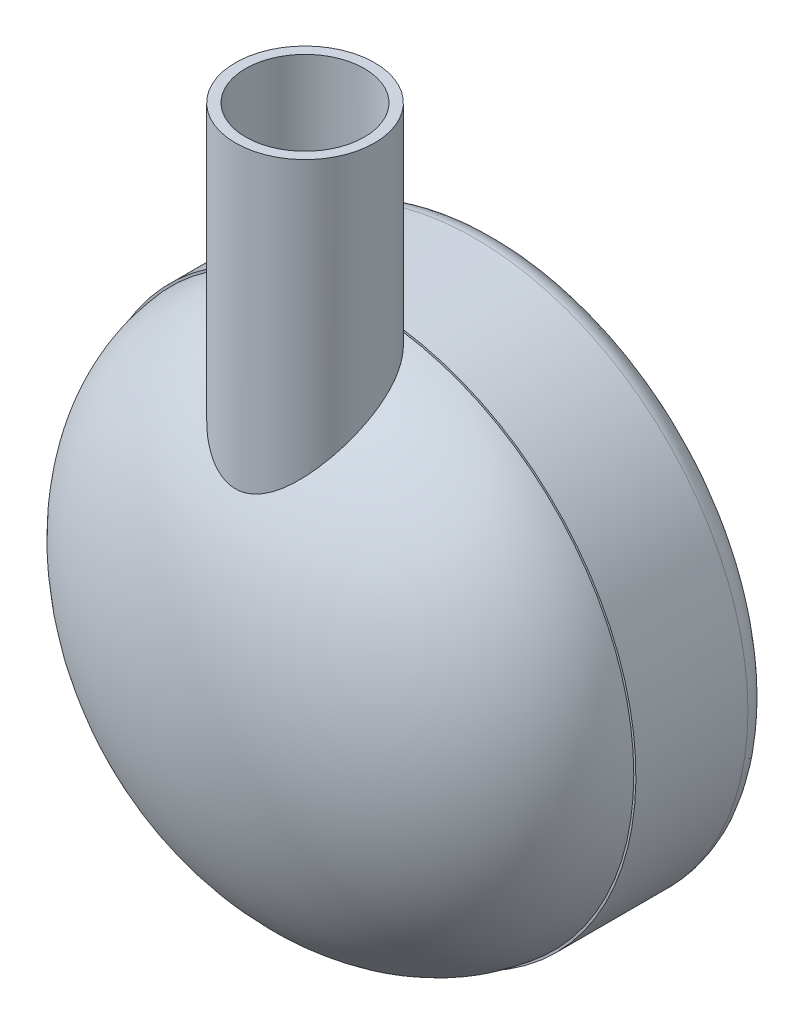
ISO-10303-21;
HEADER;
FILE_DESCRIPTION(('STEP AP214'),'2;1');
FILE_NAME('part.step','',(''),(''),'','','');
FILE_SCHEMA(('AUTOMOTIVE_DESIGN { 1 0 10303 214 1 1 1 1 }'));
ENDSEC;
DATA;
#1=APPLICATION_CONTEXT('core data for automotive mechanical design processes');
#2=APPLICATION_PROTOCOL_DEFINITION('international standard','automotive_design',2000,#1);
#3=PRODUCT_CONTEXT('',#1,'mechanical');
#4=PRODUCT('Part','Part','',(#3));
#5=PRODUCT_RELATED_PRODUCT_CATEGORY('part','',(#4));
#6=PRODUCT_DEFINITION_FORMATION('','',#4);
#7=PRODUCT_DEFINITION_CONTEXT('part definition',#1,'design');
#8=PRODUCT_DEFINITION('design','',#6,#7);
#9=PRODUCT_DEFINITION_SHAPE('','',#8);
#10=(LENGTH_UNIT() NAMED_UNIT(*) SI_UNIT(.MILLI.,.METRE.));
#11=(NAMED_UNIT(*) PLANE_ANGLE_UNIT() SI_UNIT($,.RADIAN.));
#12=(NAMED_UNIT(*) SI_UNIT($,.STERADIAN.) SOLID_ANGLE_UNIT());
#13=UNCERTAINTY_MEASURE_WITH_UNIT(LENGTH_MEASURE(1.E-05),#10,'distance_accuracy_value','');
#14=(GEOMETRIC_REPRESENTATION_CONTEXT(3) GLOBAL_UNCERTAINTY_ASSIGNED_CONTEXT((#13)) GLOBAL_UNIT_ASSIGNED_CONTEXT((#10,
#11,#12)) REPRESENTATION_CONTEXT('',''));
#15=CARTESIAN_POINT('',(0.,0.,0.));
#16=DIRECTION('',(0.,0.,1.));
#17=DIRECTION('',(1.,0.,0.));
#18=AXIS2_PLACEMENT_3D('',#15,#16,#17);
#19=CARTESIAN_POINT('',(0.,0.,30.));
#20=DIRECTION('',(0.,0.,-1.));
#21=DIRECTION('',(-1.,0.,0.));
#22=AXIS2_PLACEMENT_3D('',#19,#20,#21);
#23=CYLINDRICAL_SURFACE('',#22,80.5);
#24=CARTESIAN_POINT('',(0.,0.,0.));
#25=DIRECTION('',(0.,0.,-1.));
#26=DIRECTION('',(-1.,0.,0.));
#27=AXIS2_PLACEMENT_3D('',#24,#25,#26);
#28=CIRCLE('',#27,80.5);
#29=CARTESIAN_POINT('',(-80.5,0.,0.));
#30=VERTEX_POINT('',#29);
#31=EDGE_CURVE('E157',#30,#30,#28,.F.);
#32=ORIENTED_EDGE('',*,*,#31,.T.);
#33=EDGE_LOOP('',(#32));
#34=FACE_BOUND('',#33,.T.);
#35=CARTESIAN_POINT('',(11.4564392373896,79.6806124474455,33.));
#36=CARTESIAN_POINT('',(11.2220878181094,79.7143080596752,32.8420695559462));
#37=CARTESIAN_POINT('',(10.9844403989187,79.7474206190719,32.6889638842848));
#38=CARTESIAN_POINT('',(10.5028781935094,79.8122708437409,32.3926292261067));
#39=CARTESIAN_POINT('',(10.2589633173115,79.8440084892566,32.2494003814964));
#40=CARTESIAN_POINT('',(9.51837233566594,79.9368372093775,31.8349086606179));
#41=CARTESIAN_POINT('',(9.01279502691787,79.9955520296584,31.5788036300058));
#42=CARTESIAN_POINT('',(7.98141239486232,80.1050317111238,31.1090413243134));
#43=CARTESIAN_POINT('',(7.45560330592912,80.1557950833476,30.8953919973342));
#44=CARTESIAN_POINT('',(6.38735518565271,80.247984486276,30.5122188539234));
#45=CARTESIAN_POINT('',(5.84491709910179,80.2894110463477,30.3426925357756));
#46=CARTESIAN_POINT('',(4.74650586940751,80.3618315878747,30.048952789869));
#47=CARTESIAN_POINT('',(4.19051693906464,80.3928127093453,29.9247952025444));
#48=CARTESIAN_POINT('',(3.0696105183615,80.4434100431825,29.7231224558775));
#49=CARTESIAN_POINT('',(2.50469279579955,80.4630259594851,29.6456085116022));
#50=CARTESIAN_POINT('',(1.37040728600083,80.4903325010212,29.5379291297171));
#51=CARTESIAN_POINT('',(0.801042291539302,80.4980300868901,29.5077360552813));
#52=CARTESIAN_POINT('',(-0.338240826486871,80.5013047403233,29.4948760425023));
#53=CARTESIAN_POINT('',(-0.908158928664438,80.4968822592235,29.5122073344118));
#54=CARTESIAN_POINT('',(-2.03495667165941,80.4762153616848,29.5935613022524));
#55=CARTESIAN_POINT('',(-2.59189615721838,80.4601674796119,29.6568077918934));
#56=CARTESIAN_POINT('',(-3.69833472982087,80.4169066962689,29.8285899591556));
#57=CARTESIAN_POINT('',(-4.24783336397076,80.3896931185167,29.9371283808294));
#58=CARTESIAN_POINT('',(-5.33551582789555,80.3248345972038,30.1986091992802));
#59=CARTESIAN_POINT('',(-5.87370010188997,80.2871900640048,30.3515498492515));
#60=CARTESIAN_POINT('',(-6.9349197652561,80.2024957635583,30.7005457520391));
#61=CARTESIAN_POINT('',(-7.45795910394596,80.1554484740048,30.8965896481999));
#62=CARTESIAN_POINT('',(-8.58287968067422,80.0434930923536,31.3714279836359));
#63=CARTESIAN_POINT('',(-9.18098787882736,79.9768898911349,31.6588587115187));
#64=CARTESIAN_POINT('',(-10.0536599917039,79.8702687768623,32.1315015853088));
#65=CARTESIAN_POINT('',(-10.3401930960773,79.8336492123653,32.2957793417602));
#66=CARTESIAN_POINT('',(-10.9047898713895,79.7584893744684,32.6378450439411));
#67=CARTESIAN_POINT('',(-11.182854172701,79.7199492445909,32.8156319806594));
#68=CARTESIAN_POINT('',(-11.4564392373896,79.6806124474455,33.));
#69=B_SPLINE_CURVE_WITH_KNOTS('',3,(#35,#36,#37,#38,#39,#40,#41,#42,#43,#44,#45,#46,#47,#48,#49,
#50,#51,#52,#53,#54,#55,#56,#57,#58,#59,#60,#61,#62,#63,#64,#65,#66,#67,#68),.UNSPECIFIED.,.F.,
.F.,(4,2,2,2,2,2,2,2,2,2,2,2,2,2,2,2,4),(0.,0.853678396150907,1.7073690550526,3.41455112675234,
5.12205249828092,6.82945703564197,8.53895604650668,10.248499587896,11.9570443313581,
13.6655254516456,15.3457783163897,17.0261329955513,18.7064215776792,20.386267974087,
22.3834734499622,23.380073619323,24.3765994248601),.UNSPECIFIED.);
#70=CARTESIAN_POINT('',(11.4564392373896,79.6806124474455,33.));
#71=VERTEX_POINT('',#70);
#72=CARTESIAN_POINT('',(-11.4564392373896,79.6806124474455,33.));
#73=VERTEX_POINT('',#72);
#74=EDGE_CURVE('E11',#71,#73,#69,.T.);
#75=ORIENTED_EDGE('',*,*,#74,.F.);
#76=CARTESIAN_POINT('',(0.,0.,33.));
#77=DIRECTION('',(0.,0.,1.));
#78=DIRECTION('',(1.,0.,0.));
#79=AXIS2_PLACEMENT_3D('',#76,#77,#78);
#80=CIRCLE('',#79,80.5);
#81=EDGE_CURVE('E158',#73,#71,#80,.T.);
#82=ORIENTED_EDGE('',*,*,#81,.F.);
#83=EDGE_LOOP('',(#75,#82));
#84=FACE_BOUND('',#83,.T.);
#85=ADVANCED_FACE('F39',(#34,#84),#23,.T.);
#86=CARTESIAN_POINT('',(0.,0.,33.));
#87=DIRECTION('',(0.,0.,1.));
#88=DIRECTION('',(1.,0.,0.));
#89=AXIS2_PLACEMENT_3D('',#86,#87,#88);
#90=PLANE('',#89);
#91=CARTESIAN_POINT('',(0.,0.,33.));
#92=DIRECTION('',(0.,0.,1.));
#93=DIRECTION('',(1.,0.,0.));
#94=AXIS2_PLACEMENT_3D('',#91,#92,#93);
#95=CIRCLE('',#94,79.8738623030117);
#96=CARTESIAN_POINT('',(11.4564392373896,79.0479846624851,33.));
#97=VERTEX_POINT('',#96);
#98=CARTESIAN_POINT('',(-11.4564392373897,79.0479846624851,33.));
#99=VERTEX_POINT('',#98);
#100=EDGE_CURVE('E162',#97,#99,#95,.F.);
#101=ORIENTED_EDGE('',*,*,#100,.T.);
#102=DIRECTION('',(0.,-1.,0.));
#103=VECTOR('',#102,1.);
#104=CARTESIAN_POINT('',(-11.4564392373896,140.,33.));
#105=LINE('',#104,#103);
#106=EDGE_CURVE('E54',#99,#73,#105,.F.);
#107=ORIENTED_EDGE('',*,*,#106,.T.);
#108=ORIENTED_EDGE('',*,*,#81,.T.);
#109=DIRECTION('',(0.,-1.,0.));
#110=VECTOR('',#109,1.);
#111=CARTESIAN_POINT('',(11.4564392373896,140.,33.));
#112=LINE('',#111,#110);
#113=EDGE_CURVE('E172',#71,#97,#112,.T.);
#114=ORIENTED_EDGE('',*,*,#113,.T.);
#115=EDGE_LOOP('',(#101,#107,#108,#114));
#116=FACE_BOUND('',#115,.T.);
#117=ADVANCED_FACE('F134',(#116),#90,.T.);
#118=CARTESIAN_POINT('',(0.,0.,30.01));
#119=DIRECTION('',(0.,1.,0.));
#120=DIRECTION('',(1.,0.,0.));
#121=AXIS2_PLACEMENT_3D('',#118,#119,#120);
#122=ELLIPSE('',#121,77.,50.);
#123=TRIMMED_CURVE('',#122,(PARAMETER_VALUE(4.71238898038469)),
(PARAMETER_VALUE(7.85398163397448)),.T.,.PARAMETER.);
#124=CARTESIAN_POINT('',(0.,0.,-19.99));
#125=DIRECTION('',(0.,0.,1.));
#126=AXIS1_PLACEMENT('',#124,#125);
#127=SURFACE_OF_REVOLUTION('',#123,#126);
#128=OFFSET_SURFACE('',#127,-3.,.F.);
#129=ORIENTED_EDGE('',*,*,#100,.F.);
#130=CARTESIAN_POINT('',(1.20659414056206,51.7879905204683,70.4644601829602));
#131=CARTESIAN_POINT('',(0.937791976064763,51.7659914309396,70.480308333477));
#132=CARTESIAN_POINT('',(0.66806166898511,51.7512795175018,70.4908913816865));
#133=CARTESIAN_POINT('',(0.127857791161166,51.7366956279963,70.5013824298718));
#134=CARTESIAN_POINT('',(-0.142616096009057,51.7368314649472,70.5012848095847));
#135=CARTESIAN_POINT('',(-0.682944646592277,51.7519586279457,70.4904027558248));
#136=CARTESIAN_POINT('',(-0.952799282602544,51.7669505991597,70.4796178582292));
#137=CARTESIAN_POINT('',(-1.49107447283207,51.8115578594153,70.4474817368082));
#138=CARTESIAN_POINT('',(-1.75949218843469,51.8411955693494,70.4261143122741));
#139=CARTESIAN_POINT('',(-2.29334339305548,51.9145944255194,70.3730832748089));
#140=CARTESIAN_POINT('',(-2.55877701760135,51.9583549276404,70.3414201314463));
#141=CARTESIAN_POINT('',(-3.08565393956584,52.0592798661487,70.2681895584575));
#142=CARTESIAN_POINT('',(-3.34709746700418,52.116443526743,70.2266227020694));
#143=CARTESIAN_POINT('',(-3.99058622596073,52.2740450396703,70.1116289648175));
#144=CARTESIAN_POINT('',(-4.36979142396988,52.3820397140063,70.0325170036849));
#145=CARTESIAN_POINT('',(-5.11561571059511,52.6225575558843,69.8551634439567));
#146=CARTESIAN_POINT('',(-5.4822347079934,52.7550809011519,69.7569217067536));
#147=CARTESIAN_POINT('',(-6.20190329691188,53.0415020670448,69.5429627602409));
#148=CARTESIAN_POINT('',(-6.55494672759613,53.1954094493173,69.4272377314285));
#149=CARTESIAN_POINT('',(-7.24681130731422,53.5215341826441,69.1799050685356));
#150=CARTESIAN_POINT('',(-7.58562788136326,53.6937573616281,69.0482923773268));
#151=CARTESIAN_POINT('',(-8.17824772048955,54.0154029521234,68.8001694568294));
#152=CARTESIAN_POINT('',(-8.43481078821802,54.1618885857648,68.6863971315566));
#153=CARTESIAN_POINT('',(-8.93895229246999,54.4632084393317,68.4505434589534));
#154=CARTESIAN_POINT('',(-9.1865324942083,54.6180410039804,68.3284637578054));
#155=CARTESIAN_POINT('',(-9.91631844979197,55.093613779298,67.95040518659));
#156=CARTESIAN_POINT('',(-10.3853848250546,55.4253271327585,67.6826850360663));
#157=CARTESIAN_POINT('',(-11.2905454256298,56.111210757627,67.1189535679477));
#158=CARTESIAN_POINT('',(-11.7265622525856,56.4654303772367,66.8228793051826));
#159=CARTESIAN_POINT('',(-12.5659967788804,57.1899475346687,66.2054657291739));
#160=CARTESIAN_POINT('',(-12.9694160017707,57.5602443198292,65.8841275981031));
#161=CARTESIAN_POINT('',(-13.7276880180025,58.2956875004309,65.2328316348798));
#162=CARTESIAN_POINT('',(-14.0839007817802,58.6603349577254,64.9038868102714));
#163=CARTESIAN_POINT('',(-14.7685648519231,59.3970715563791,64.225741180301));
#164=CARTESIAN_POINT('',(-15.0970069303971,59.7691631209387,63.8765337063765));
#165=CARTESIAN_POINT('',(-15.7264873697078,60.518039870574,63.1588541978597));
#166=CARTESIAN_POINT('',(-16.0275214277577,60.8948257820964,62.790379152696));
#167=CARTESIAN_POINT('',(-16.60244316487,61.6509940897322,62.034717237465));
#168=CARTESIAN_POINT('',(-16.8763118991493,62.030378103338,61.6475175851379));
#169=CARTESIAN_POINT('',(-17.3964236618642,62.7893897270825,60.8553621679053));
#170=CARTESIAN_POINT('',(-17.6426715470377,63.1690172825539,60.4504095420824));
#171=CARTESIAN_POINT('',(-18.1070713715574,63.9267003619109,59.6233514720929));
#172=CARTESIAN_POINT('',(-18.325223653616,64.3047559049175,59.2012462372379));
#173=CARTESIAN_POINT('',(-18.8381432310015,65.2524634779197,58.1176713906004));
#174=CARTESIAN_POINT('',(-19.1141507011164,65.8200403954712,57.4453540022784));
#175=CARTESIAN_POINT('',(-19.5958446317334,66.9418942073725,56.0652441101202));
#176=CARTESIAN_POINT('',(-19.8015223638832,67.4961694429707,55.3574472155487));
#177=CARTESIAN_POINT('',(-20.1370964826392,68.5848561620584,53.9111410305247));
#178=CARTESIAN_POINT('',(-20.2671378050026,69.1193037864978,53.1726934034869));
#179=CARTESIAN_POINT('',(-20.401218120987,69.9023064453572,52.0453583288001));
#180=CARTESIAN_POINT('',(-20.43574753057,70.1601702360062,51.6663428018726));
#181=CARTESIAN_POINT('',(-20.4837090061955,70.6691509642165,50.9023293728933));
#182=CARTESIAN_POINT('',(-20.4971359743529,70.9202662570929,50.517330047966));
#183=CARTESIAN_POINT('',(-20.503162077382,71.5279646335238,49.5653501039556));
#184=CARTESIAN_POINT('',(-20.4834510873896,71.8803477781111,48.9955471310331));
#185=CARTESIAN_POINT('',(-20.3949415108202,72.566904926558,47.8489784795473));
#186=CARTESIAN_POINT('',(-20.3261544474121,72.901083185142,47.2722144666983));
#187=CARTESIAN_POINT('',(-20.1371976800687,73.5492066550072,46.1158921069584));
#188=CARTESIAN_POINT('',(-20.0170439733428,73.863158130554,45.5363346855377));
#189=CARTESIAN_POINT('',(-19.7233955666876,74.4690821006087,44.3791492049445));
#190=CARTESIAN_POINT('',(-19.5498993218069,74.7610539582194,43.8015212021433));
#191=CARTESIAN_POINT('',(-19.1468227860935,75.3233382497265,42.6499100727181));
#192=CARTESIAN_POINT('',(-18.9168681212249,75.5934894096367,42.0759786604108));
#193=CARTESIAN_POINT('',(-18.400892840962,76.10866779063,40.9421275474517));
#194=CARTESIAN_POINT('',(-18.1148713788566,76.3536946322049,40.3822080585495));
#195=CARTESIAN_POINT('',(-17.4872580346571,76.8177827316392,39.2833782227497));
#196=CARTESIAN_POINT('',(-17.1456857321788,77.036853091342,38.7444605561505));
#197=CARTESIAN_POINT('',(-16.4083681844915,77.448892477827,37.6944387524338));
#198=CARTESIAN_POINT('',(-16.0126296831118,77.6418647479508,37.1833311639443));
#199=CARTESIAN_POINT('',(-15.2180154135825,77.981351334634,36.2525514477759));
#200=CARTESIAN_POINT('',(-14.8247207293026,78.1306559595612,35.829119946533));
#201=CARTESIAN_POINT('',(-14.0001675963896,78.4096488617279,35.0139629835115));
#202=CARTESIAN_POINT('',(-13.5689121883543,78.5393387078243,34.6222349871445));
#203=CARTESIAN_POINT('',(-12.6715528176902,78.7798796687796,33.8747810863939));
#204=CARTESIAN_POINT('',(-12.2054571088017,78.8907352252819,33.5190467017526));
#205=CARTESIAN_POINT('',(-11.2418249492627,79.0946275450975,32.8472653635153));
#206=CARTESIAN_POINT('',(-10.7442891759062,79.1876646920879,32.5312175554135));
#207=CARTESIAN_POINT('',(-9.7505725238103,79.3522128202904,31.9587592628851));
#208=CARTESIAN_POINT('',(-9.2559004087086,79.4246424406765,31.69998945825));
#209=CARTESIAN_POINT('',(-8.24558007213614,79.5555079554271,31.22308805645));
#210=CARTESIAN_POINT('',(-7.72993281341674,79.6139444912228,31.0049545966504));
#211=CARTESIAN_POINT('',(-6.68139169076643,79.7176800643382,30.6112763592004));
#212=CARTESIAN_POINT('',(-6.14849894284392,79.7629799498885,30.4357288319052));
#213=CARTESIAN_POINT('',(-5.06926648789172,79.8411963683607,30.1287321361378));
#214=CARTESIAN_POINT('',(-4.52292666652687,79.8741127959523,29.9972833427587));
#215=CARTESIAN_POINT('',(-3.42421409956011,79.9279848528091,29.7802979574557));
#216=CARTESIAN_POINT('',(-2.87190104820085,79.9490145309681,29.694477326983));
#217=CARTESIAN_POINT('',(-1.76180573994504,79.9798294194175,29.5682085568223));
#218=CARTESIAN_POINT('',(-1.20402352368469,79.9896147131904,29.5277600802741));
#219=CARTESIAN_POINT('',(-0.0869237998134725,79.9981327888279,29.4925686788761));
#220=CARTESIAN_POINT('',(0.47239373922858,79.9968653427077,29.4978266968137));
#221=CARTESIAN_POINT('',(1.58859716879322,79.9832523329695,29.5540070868946));
#222=CARTESIAN_POINT('',(2.14548305156798,79.9709067340797,29.6049296044294));
#223=CARTESIAN_POINT('',(3.25409373910769,79.9348574307487,29.7521796031236));
#224=CARTESIAN_POINT('',(3.80580454550774,79.9111288745036,29.8486064238658));
#225=CARTESIAN_POINT('',(4.8988896335491,79.8518577251704,30.0860931373618));
#226=CARTESIAN_POINT('',(5.44026390899166,79.8163151249977,30.2271530568809));
#227=CARTESIAN_POINT('',(6.50878995699872,79.7327926669419,30.552697635545));
#228=CARTESIAN_POINT('',(7.03594225179918,79.6848132664305,30.7371806977517));
#229=CARTESIAN_POINT('',(8.07227715555514,79.5756494017774,31.1479704065846));
#230=CARTESIAN_POINT('',(8.58145981807737,79.5144649770032,31.3742769285241));
#231=CARTESIAN_POINT('',(9.57745985038608,79.3781334187561,31.8663210466109));
#232=CARTESIAN_POINT('',(10.0643106075581,79.3030080366891,32.1319970880488));
#233=CARTESIAN_POINT('',(11.0130669038489,79.1378329621718,32.7006294353654));
#234=CARTESIAN_POINT('',(11.4749725363398,79.0477833255894,33.0035856016868));
#235=CARTESIAN_POINT('',(12.3706263791387,78.8518904776894,33.6439420406911));
#236=CARTESIAN_POINT('',(12.8043775371228,78.7460489235707,33.9813386980274));
#237=CARTESIAN_POINT('',(13.6409247843456,78.5177693406247,34.6874311134508));
#238=CARTESIAN_POINT('',(14.0437208764792,78.3953313133496,35.0561268686107));
#239=CARTESIAN_POINT('',(14.816208169968,78.1330976101586,35.8216394320443));
#240=CARTESIAN_POINT('',(15.1858718030853,77.9932877063821,36.218479175026));
#241=CARTESIAN_POINT('',(15.8896882749182,77.6959317656665,37.0362489841735));
#242=CARTESIAN_POINT('',(16.2238412775272,77.5383858105922,37.457178939141));
#243=CARTESIAN_POINT('',(16.8550999774945,77.205332534169,38.3192035472265));
#244=CARTESIAN_POINT('',(17.1522058167381,77.029825281614,38.760298123108));
#245=CARTESIAN_POINT('',(17.7083576361444,76.660878451085,39.6586658556837));
#246=CARTESIAN_POINT('',(17.9674028031473,76.4674384901258,40.1159393577789));
#247=CARTESIAN_POINT('',(18.454232937024,76.0567539053512,41.0568276457864));
#248=CARTESIAN_POINT('',(18.6808261065571,75.8389638548285,41.5408205470695));
#249=CARTESIAN_POINT('',(19.0930640966643,75.3852390420143,42.5176231011775));
#250=CARTESIAN_POINT('',(19.2787082957852,75.1493040044225,43.0104328876873));
#251=CARTESIAN_POINT('',(19.6095878620111,74.660061268758,44.0010944551148));
#252=CARTESIAN_POINT('',(19.7548133776408,74.4067493540406,44.4989474346472));
#253=CARTESIAN_POINT('',(20.0057147030785,73.8838318159086,45.496033487592));
#254=CARTESIAN_POINT('',(20.1113887959163,73.6142254857258,45.9952666199709));
#255=CARTESIAN_POINT('',(20.2926882379426,73.0333872733302,47.0396134593306));
#256=CARTESIAN_POINT('',(20.3644750810688,72.7206400280383,47.5845506260423));
#257=CARTESIAN_POINT('',(20.4639685242951,72.0786953026922,48.6686917395528));
#258=CARTESIAN_POINT('',(20.4916726676889,71.749496906878,49.207895365161));
#259=CARTESIAN_POINT('',(20.5050999699691,71.0763612929149,50.2776794060184));
#260=CARTESIAN_POINT('',(20.4908134469848,70.7324206936442,50.8082578041705));
#261=CARTESIAN_POINT('',(20.4223869080537,70.03169267302,51.8582074052355));
#262=CARTESIAN_POINT('',(20.3682449433084,69.6749046242803,52.3775780588487));
#263=CARTESIAN_POINT('',(20.2099820550731,68.8897353660253,53.4888508661121));
#264=CARTESIAN_POINT('',(20.099021139968,68.4593537425731,54.0783700601819));
#265=CARTESIAN_POINT('',(19.8287192231249,67.5864641804844,55.2369694137281));
#266=CARTESIAN_POINT('',(19.6693733375044,67.1439550218226,55.8060475034325));
#267=CARTESIAN_POINT('',(19.3047734604709,66.2492026102116,56.922498441264));
#268=CARTESIAN_POINT('',(19.0994663830452,65.7969486521618,57.4698453217813));
#269=CARTESIAN_POINT('',(18.6452556533199,64.8861460040988,58.54064993598));
#270=CARTESIAN_POINT('',(18.3963507708999,64.4275971368102,59.0641069950802));
#271=CARTESIAN_POINT('',(17.8049445306653,63.4191486762224,60.1837107619812));
#272=CARTESIAN_POINT('',(17.4536470688026,62.8685574565628,60.7746023952889));
#273=CARTESIAN_POINT('',(16.6930689815809,61.7680964754024,61.9190483258269));
#274=CARTESIAN_POINT('',(16.283772492136,61.2182269529717,62.4725923462626));
#275=CARTESIAN_POINT('',(15.626846737362,60.3992074459451,63.2729281173368));
#276=CARTESIAN_POINT('',(15.4007391878456,60.1271989921931,63.5346788954851));
#277=CARTESIAN_POINT('',(14.9340415570458,59.585984075579,64.0479438434133));
#278=CARTESIAN_POINT('',(14.6934529102658,59.3167773382663,64.2994590230122));
#279=CARTESIAN_POINT('',(14.1976943191453,58.782292695095,64.7918044727981));
#280=CARTESIAN_POINT('',(13.9425295500124,58.5170134364036,65.032638482014));
#281=CARTESIAN_POINT('',(13.417294898398,57.9915101218862,65.5032421529833));
#282=CARTESIAN_POINT('',(13.1472264484171,57.7312855834536,65.733012874148));
#283=CARTESIAN_POINT('',(12.5143987213219,57.1455943640744,66.2433987554053));
#284=CARTESIAN_POINT('',(12.1467782524905,56.8221497486437,66.5203444267514));
#285=CARTESIAN_POINT('',(11.3856241208255,56.1891508743281,67.0538426600653));
#286=CARTESIAN_POINT('',(10.9920909371567,55.8795963587721,67.3103955989319));
#287=CARTESIAN_POINT('',(10.1785169016961,55.2789482162105,67.800932543983));
#288=CARTESIAN_POINT('',(9.75850538023683,54.9878348544956,68.0349408208961));
#289=CARTESIAN_POINT('',(8.89072468096245,54.4290206556242,68.4781557089031));
#290=CARTESIAN_POINT('',(8.44296447285012,54.1613123196058,68.6873702714825));
#291=CARTESIAN_POINT('',(7.64360632848149,53.7238434628962,69.0252335481842));
#292=CARTESIAN_POINT('',(7.29857237659459,53.547116580722,69.1604085859651));
#293=CARTESIAN_POINT('',(6.59351576493065,53.2125489059662,69.414322612929));
#294=CARTESIAN_POINT('',(6.23349273322129,53.0547085824042,69.5330611939486));
#295=CARTESIAN_POINT('',(5.49999395928165,52.7615569958205,69.7521178328382));
#296=CARTESIAN_POINT('',(5.12655377835015,52.6261908539281,69.8524808249331));
#297=CARTESIAN_POINT('',(4.36684236789028,52.38098394666,70.0332989675777));
#298=CARTESIAN_POINT('',(3.98057753027358,52.2711306774233,70.11376387144));
#299=CARTESIAN_POINT('',(3.20058379755791,52.0810394412511,70.2524464761992));
#300=CARTESIAN_POINT('',(2.80695402908462,52.0005425661484,70.3108588389215));
#301=CARTESIAN_POINT('',(2.21072016884662,51.9030416533487,70.3814348402733));
#302=CARTESIAN_POINT('',(2.01094421930551,51.8744098428928,70.4021237366388));
#303=CARTESIAN_POINT('',(1.60981837064125,51.8251438296793,70.4376862318021));
#304=CARTESIAN_POINT('',(1.40846800118159,51.8045121178356,70.452558019395));
#305=CARTESIAN_POINT('',(1.20659414056206,51.7879905204683,70.4644601829602));
#306=B_SPLINE_CURVE_WITH_KNOTS('',3,(#130,#131,#132,#133,#134,#135,#136,#137,#138,#139,#140,
#141,#142,#143,#144,#145,#146,#147,#148,#149,#150,#151,#152,#153,#154,#155,#156,#157,#158,#159,
#160,#161,#162,#163,#164,#165,#166,#167,#168,#169,#170,#171,#172,#173,#174,#175,#176,#177,#178,
#179,#180,#181,#182,#183,#184,#185,#186,#187,#188,#189,#190,#191,#192,#193,#194,#195,#196,#197,
#198,#199,#200,#201,#202,#203,#204,#205,#206,#207,#208,#209,#210,#211,#212,#213,#214,#215,#216,
#217,#218,#219,#220,#221,#222,#223,#224,#225,#226,#227,#228,#229,#230,#231,#232,#233,#234,#235,
#236,#237,#238,#239,#240,#241,#242,#243,#244,#245,#246,#247,#248,#249,#250,#251,#252,#253,#254,
#255,#256,#257,#258,#259,#260,#261,#262,#263,#264,#265,#266,#267,#268,#269,#270,#271,#272,#273,
#274,#275,#276,#277,#278,#279,#280,#281,#282,#283,#284,#285,#286,#287,#288,#289,#290,#291,#292,
#293,#294,#295,#296,#297,#298,#299,#300,#301,#302,#303,#304,#305),.UNSPECIFIED.,.T.,.F.,(4,2,2,
2,2,2,2,2,2,2,2,2,2,2,2,2,2,2,2,2,2,2,2,2,2,2,2,2,2,2,2,2,2,2,2,2,2,2,2,2,2,2,2,2,2,2,2,2,2,2,2,
2,2,2,2,2,2,2,2,2,2,2,2,2,2,2,2,2,2,2,2,2,2,2,2,2,2,2,2,2,2,2,2,2,2,2,2,4),(0.,
0.810379004711193,1.62118444012351,2.43202508841733,3.24411090131532,4.05615968169732,
4.86816147119155,6.07296695368599,7.27778116609924,8.48313584267995,9.68887520685101,
10.6382756517904,11.587488509163,13.4865867984531,15.3900033186182,17.2933308251221,
19.1123136305481,20.9318985076981,22.7517685508003,24.5728989564396,26.3937086382518,
28.2144961075737,30.9773646917558,33.740576040546,36.4984748831371,37.87713995435,
39.2561380295008,41.2648213850291,43.2730332524881,45.280620153873,47.2882652061512,
49.309600550256,51.3309664225676,53.3516213761371,55.3720249814867,57.16036866474,
58.9485692344232,60.736347510107,62.5240872859029,64.2109157165684,65.8976668096033,
67.5843089652281,69.2709654666615,70.9469956936214,72.6230134770071,74.2990658316733,
75.9751235227527,77.6548572311185,79.334591946777,81.0142648978211,82.6939328414069,
84.3710017845872,86.0480644498972,87.7249512483904,89.4018378900624,91.0801070966877,
92.7583685571987,94.4366235900101,96.1149144732352,97.8442999266289,99.5737116238595,
101.303544472012,103.033452405377,104.928741347582,106.824135909578,108.719967530712,
110.61589185786,112.8286418935,115.041615354009,117.257158148987,119.472763466,122.112289298426,
124.752538501296,126.072330455589,127.391991885221,128.711187650585,130.030256838598,
131.716825790981,133.403363564928,135.088064897526,136.772224466234,138.002981612307,
139.23376931606,140.461505935131,141.688639564589,142.904672656571,143.513088360376,
144.121693348926),.UNSPECIFIED.);
#307=EDGE_CURVE('E159',#97,#99,#306,.T.);
#308=ORIENTED_EDGE('',*,*,#307,.T.);
#309=EDGE_LOOP('',(#129,#308));
#310=FACE_BOUND('',#309,.T.);
#311=CARTESIAN_POINT('',(0.,0.,83.01));
#312=VERTEX_POINT('',#311);
#313=VERTEX_LOOP('',#312);
#314=FACE_BOUND('',#313,.T.);
#315=ADVANCED_FACE('F139',(#310,#314),#128,.F.);
#316=CARTESIAN_POINT('',(0.,0.,0.));
#317=DIRECTION('',(0.,-1.,0.));
#318=DIRECTION('',(1.,0.,0.));
#319=AXIS2_PLACEMENT_3D('',#316,#317,#318);
#320=ELLIPSE('',#319,77.5,15.);
#321=TRIMMED_CURVE('',#320,(PARAMETER_VALUE(4.71238898038469)),
(PARAMETER_VALUE(7.85398163397448)),.T.,.PARAMETER.);
#322=CARTESIAN_POINT('',(0.,0.,15.));
#323=DIRECTION('',(0.,0.,-1.));
#324=AXIS1_PLACEMENT('',#322,#323);
#325=SURFACE_OF_REVOLUTION('',#321,#324);
#326=OFFSET_SURFACE('',#325,-3.,.F.);
#327=CARTESIAN_POINT('',(0.,0.,-18.));
#328=VERTEX_POINT('',#327);
#329=VERTEX_LOOP('',#328);
#330=FACE_BOUND('',#329,.T.);
#331=ORIENTED_EDGE('',*,*,#31,.F.);
#332=EDGE_LOOP('',(#331));
#333=FACE_BOUND('',#332,.T.);
#334=ADVANCED_FACE('F147',(#330,#333),#326,.F.);
#335=CARTESIAN_POINT('',(0.,140.,50.));
#336=DIRECTION('',(0.,-1.,0.));
#337=DIRECTION('',(0.,0.,-1.));
#338=AXIS2_PLACEMENT_3D('',#335,#336,#337);
#339=CYLINDRICAL_SURFACE('',#338,20.5);
#340=ORIENTED_EDGE('',*,*,#113,.F.);
#341=ORIENTED_EDGE('',*,*,#74,.T.);
#342=ORIENTED_EDGE('',*,*,#106,.F.);
#343=ORIENTED_EDGE('',*,*,#307,.F.);
#344=EDGE_LOOP('',(#340,#341,#342,#343));
#345=FACE_BOUND('',#344,.T.);
#346=CARTESIAN_POINT('',(0.,140.,50.));
#347=DIRECTION('',(0.,1.,0.));
#348=DIRECTION('',(0.,0.,1.));
#349=AXIS2_PLACEMENT_3D('',#346,#347,#348);
#350=CIRCLE('',#349,20.5);
#351=CARTESIAN_POINT('',(0.,140.,70.5));
#352=VERTEX_POINT('',#351);
#353=EDGE_CURVE('E165',#352,#352,#350,.T.);
#354=ORIENTED_EDGE('',*,*,#353,.F.);
#355=EDGE_LOOP('',(#354));
#356=FACE_BOUND('',#355,.T.);
#357=ADVANCED_FACE('F144',(#345,#356),#339,.T.);
#358=CARTESIAN_POINT('',(0.,140.,50.));
#359=DIRECTION('',(0.,1.,0.));
#360=DIRECTION('',(0.,0.,1.));
#361=AXIS2_PLACEMENT_3D('',#358,#359,#360);
#362=PLANE('',#361);
#363=CARTESIAN_POINT('',(0.,140.,50.));
#364=DIRECTION('',(0.,1.,0.));
#365=DIRECTION('',(0.,0.,1.));
#366=AXIS2_PLACEMENT_3D('',#363,#364,#365);
#367=CIRCLE('',#366,17.5);
#368=CARTESIAN_POINT('',(0.,140.,67.5));
#369=VERTEX_POINT('',#368);
#370=EDGE_CURVE('E94',#369,#369,#367,.T.);
#371=ORIENTED_EDGE('',*,*,#370,.F.);
#372=EDGE_LOOP('',(#371));
#373=FACE_BOUND('',#372,.T.);
#374=ORIENTED_EDGE('',*,*,#353,.T.);
#375=EDGE_LOOP('',(#374));
#376=FACE_BOUND('',#375,.T.);
#377=ADVANCED_FACE('F86',(#373,#376),#362,.T.);
#378=CARTESIAN_POINT('',(0.,0.,30.01));
#379=DIRECTION('',(0.,1.,0.));
#380=DIRECTION('',(1.,0.,0.));
#381=AXIS2_PLACEMENT_3D('',#378,#379,#380);
#382=ELLIPSE('',#381,77.,50.);
#383=TRIMMED_CURVE('',#382,(PARAMETER_VALUE(4.71238898038469)),
(PARAMETER_VALUE(7.85398163397448)),.T.,.PARAMETER.);
#384=CARTESIAN_POINT('',(0.,0.,-19.99));
#385=DIRECTION('',(0.,0.,1.));
#386=AXIS1_PLACEMENT('',#384,#385);
#387=SURFACE_OF_REVOLUTION('',#383,#386);
#388=CARTESIAN_POINT('',(0.,0.,30.01));
#389=DIRECTION('',(0.,0.,1.));
#390=DIRECTION('',(1.,0.,0.));
#391=AXIS2_PLACEMENT_3D('',#388,#389,#390);
#392=CIRCLE('',#391,77.);
#393=CARTESIAN_POINT('',(-77.,0.,30.01));
#394=VERTEX_POINT('',#393);
#395=EDGE_CURVE('E93',#394,#394,#392,.T.);
#396=ORIENTED_EDGE('',*,*,#395,.F.);
#397=EDGE_LOOP('',(#396));
#398=FACE_BOUND('',#397,.T.);
#399=CARTESIAN_POINT('',(0.,0.,80.01));
#400=VERTEX_POINT('',#399);
#401=VERTEX_LOOP('',#400);
#402=FACE_BOUND('',#401,.T.);
#403=CARTESIAN_POINT('',(0.,76.9044591869678,32.5));
#404=CARTESIAN_POINT('',(0.471402158203041,76.9044592089468,32.5000001524649));
#405=CARTESIAN_POINT('',(0.942807079878041,76.8986682633462,32.519061811931));
#406=CARTESIAN_POINT('',(1.88225634343871,76.8754320139524,32.5951385461765));
#407=CARTESIAN_POINT('',(2.35030066664855,76.8579866454428,32.6521538317105));
#408=CARTESIAN_POINT('',(3.27970426512618,76.81122847336,32.8036274845758));
#409=CARTESIAN_POINT('',(3.74106334238024,76.7819153190101,32.8980869586453));
#410=CARTESIAN_POINT('',(4.65379383143092,76.7110845696024,33.1235909369404));
#411=CARTESIAN_POINT('',(5.10516526815819,76.6695670050125,33.2546353498334));
#412=CARTESIAN_POINT('',(5.99466505923936,76.5738956948154,33.5520857114035));
#413=CARTESIAN_POINT('',(6.43279494595171,76.5197434177147,33.7184875503596));
#414=CARTESIAN_POINT('',(7.29278002396972,76.3982960679892,34.0851059460401));
#415=CARTESIAN_POINT('',(7.71463525230936,76.3310010252737,34.2853224258116));
#416=CARTESIAN_POINT('',(8.53911015434365,76.182743890071,34.717649325372));
#417=CARTESIAN_POINT('',(8.94173161663602,76.1017830715865,34.9497567717259));
#418=CARTESIAN_POINT('',(9.72506955286706,75.9256768435431,35.4436471034533));
#419=CARTESIAN_POINT('',(10.105785993445,75.8305314123824,35.7054300340198));
#420=CARTESIAN_POINT('',(10.8441074656762,75.6252611483235,36.257059975861));
#421=CARTESIAN_POINT('',(11.2016303939596,75.5150869745025,36.5469984816326));
#422=CARTESIAN_POINT('',(11.8900055837489,75.2796607471828,37.1513599750507));
#423=CARTESIAN_POINT('',(12.2208579256366,75.1544087391295,37.4657828888987));
#424=CARTESIAN_POINT('',(12.8541084097574,74.8886281689217,38.1160668273719));
#425=CARTESIAN_POINT('',(13.1565068705837,74.7480997778521,38.4519276118903));
#426=CARTESIAN_POINT('',(13.731481616281,74.4517380572232,39.1419108442113));
#427=CARTESIAN_POINT('',(14.0040573096394,74.295904424212,39.4960336540228));
#428=CARTESIAN_POINT('',(14.5260945448463,73.9642234512021,40.2300764963368));
#429=CARTESIAN_POINT('',(14.7746261201283,73.7879183327803,40.6104507041829));
#430=CARTESIAN_POINT('',(15.2384817958515,73.4196313915339,41.3836237926464));
#431=CARTESIAN_POINT('',(15.4538054116583,73.2276493399838,41.7764228544904));
#432=CARTESIAN_POINT('',(15.8511684427094,72.8285493894564,42.5711456414775));
#433=CARTESIAN_POINT('',(16.033201391369,72.6214285607426,42.9730711223839));
#434=CARTESIAN_POINT('',(16.364225448244,72.1928313871494,43.7828081376339));
#435=CARTESIAN_POINT('',(16.5132152133133,71.9713544591931,44.1906199105274));
#436=CARTESIAN_POINT('',(16.7904089137678,71.4949320285607,45.0450854651175));
#437=CARTESIAN_POINT('',(16.9156497844385,71.2387541161318,45.4920131119264));
#438=CARTESIAN_POINT('',(17.128943771757,70.7117338945692,46.3860628795034));
#439=CARTESIAN_POINT('',(17.2169949785147,70.4408908331066,46.8331850090792));
#440=CARTESIAN_POINT('',(17.3573476171682,69.8858286412786,47.7248636776253));
#441=CARTESIAN_POINT('',(17.4096390957689,69.6016058103229,48.1694194681731));
#442=CARTESIAN_POINT('',(17.4800087172025,69.0212346103215,49.0534461269277));
#443=CARTESIAN_POINT('',(17.4980824078654,68.7250846945292,49.4929163260419));
#444=CARTESIAN_POINT('',(17.5019118916384,68.0740302139422,50.4345093687272));
#445=CARTESIAN_POINT('',(17.482031836713,67.7173085161735,50.9354014939139));
#446=CARTESIAN_POINT('',(17.4008861829737,66.991933185017,51.9250233778383));
#447=CARTESIAN_POINT('',(17.3396166991936,66.6232784346412,52.4137519903979));
#448=CARTESIAN_POINT('',(17.1779636335569,65.875979754763,53.3773315061758));
#449=CARTESIAN_POINT('',(17.0775564357734,65.4973299230207,53.8521738440089));
#450=CARTESIAN_POINT('',(16.8396943875795,64.7323832703216,54.7861186138849));
#451=CARTESIAN_POINT('',(16.702238090705,64.3460861513465,55.2452204306003));
#452=CARTESIAN_POINT('',(16.3606674589337,63.4893186253678,56.2375302167568));
#453=CARTESIAN_POINT('',(16.1486970590191,63.0176070879201,56.7669753585882));
#454=CARTESIAN_POINT('',(15.6760118162167,62.0698549993552,57.799695676529));
#455=CARTESIAN_POINT('',(15.4152878661295,61.5938136552587,58.302965940665));
#456=CARTESIAN_POINT('',(14.8463090345765,60.6410755209071,59.2821343794175));
#457=CARTESIAN_POINT('',(14.5380165783219,60.1643785103404,59.7580105035548));
#458=CARTESIAN_POINT('',(13.8745669189797,59.215261041833,60.6803137677662));
#459=CARTESIAN_POINT('',(13.5194190061228,58.7428397559168,61.126746719413));
#460=CARTESIAN_POINT('',(12.824578557638,57.8852523367223,61.91675326431));
#461=CARTESIAN_POINT('',(12.4921093476662,57.4986215617007,62.2650985143687));
#462=CARTESIAN_POINT('',(11.7931702085054,56.7358169411762,62.9385757594739));
#463=CARTESIAN_POINT('',(11.4266967365319,56.3596441905761,63.2637053295018));
#464=CARTESIAN_POINT('',(10.6589016090258,55.6231744095501,63.8882070593044));
#465=CARTESIAN_POINT('',(10.2576389603855,55.2628520015679,64.1876211824354));
#466=CARTESIAN_POINT('',(9.62805468081289,54.7386954405042,64.6155690650061));
#467=CARTESIAN_POINT('',(9.41360269899659,54.5667153399803,64.754675684736));
#468=CARTESIAN_POINT('',(8.97517072079432,54.2291326753669,65.0254017515995));
#469=CARTESIAN_POINT('',(8.7511914863252,54.063529603302,65.1570217954918));
#470=CARTESIAN_POINT('',(8.23267669785367,53.6968001719353,65.4461327087204));
#471=CARTESIAN_POINT('',(7.93519536933692,53.497914239071,65.601215648136));
#472=CARTESIAN_POINT('',(7.32418963082887,53.1147152931072,65.8972155734126));
#473=CARTESIAN_POINT('',(7.01066600621419,52.9304015677238,66.0381332517576));
#474=CARTESIAN_POINT('',(6.36774174655274,52.5796042782654,66.3040714683315));
#475=CARTESIAN_POINT('',(6.03835858399968,52.413101715115,66.429108973076));
#476=CARTESIAN_POINT('',(5.36375489664599,52.1012855047188,66.6615514652476));
#477=CARTESIAN_POINT('',(5.01854037970136,51.9559639055457,66.7689630718468));
#478=CARTESIAN_POINT('',(4.38402212713595,51.7170289925765,66.9444943019463));
#479=CARTESIAN_POINT('',(4.09740562646814,51.6188917012246,67.0161730899281));
#480=CARTESIAN_POINT('',(3.51556969808303,51.4406530932143,67.1458322188385));
#481=CARTESIAN_POINT('',(3.22035119821348,51.360549839403,67.203814031081));
#482=CARTESIAN_POINT('',(2.62296171542553,51.2203856566541,67.3049630307733));
#483=CARTESIAN_POINT('',(2.32079741258464,51.1603062665643,67.3481438651467));
#484=CARTESIAN_POINT('',(1.71112734136618,51.0617441920068,67.418845978372));
#485=CARTESIAN_POINT('',(1.40362160555729,51.0232613759044,67.4463673526709));
#486=CARTESIAN_POINT('',(0.783908975457924,50.9689128079276,67.4852045066296));
#487=CARTESIAN_POINT('',(0.471685702511126,50.9531696350172,67.4964324574348));
#488=CARTESIAN_POINT('',(-0.153216999391571,50.9451999573257,67.5021186223618));
#489=CARTESIAN_POINT('',(-0.465896428981499,50.9529734852626,67.4965768131524));
#490=CARTESIAN_POINT('',(-1.08916566173126,50.9917908561837,67.4688601484621));
#491=CARTESIAN_POINT('',(-1.39975464649339,51.0228433324748,67.4466791221047));
#492=CARTESIAN_POINT('',(-2.01627323293497,51.1072577475244,67.3862184537163));
#493=CARTESIAN_POINT('',(-2.32220282307836,51.1606197415091,67.3479387718338));
#494=CARTESIAN_POINT('',(-2.90554093591168,51.2835148428192,67.2594473514539));
#495=CARTESIAN_POINT('',(-3.18341760764934,51.3516078791984,67.2102925210109));
#496=CARTESIAN_POINT('',(-3.73221196312969,51.5041862233106,67.0996778616163));
#497=CARTESIAN_POINT('',(-4.00312713124597,51.5886773649354,67.0382136531551));
#498=CARTESIAN_POINT('',(-4.53696630317687,51.772389274425,66.9038959473118));
#499=CARTESIAN_POINT('',(-4.79989091885164,51.8716089110445,66.831043324612));
#500=CARTESIAN_POINT('',(-5.31723895612486,52.0831472003578,66.6748320274659));
#501=CARTESIAN_POINT('',(-5.57166019451017,52.1954691842981,66.5914706807601));
#502=CARTESIAN_POINT('',(-6.23918843664544,52.5107544618979,66.3559933657035));
#503=CARTESIAN_POINT('',(-6.64442052937227,52.7240311273242,66.1952290989487));
#504=CARTESIAN_POINT('',(-7.42993312558812,53.1760921598758,65.8502474837441));
#505=CARTESIAN_POINT('',(-7.8101994034056,53.4148908694403,65.6660169368472));
#506=CARTESIAN_POINT('',(-8.54724774631864,53.9131453564471,65.2764122493332));
#507=CARTESIAN_POINT('',(-8.90396155966625,54.1726567352321,65.0709807322804));
#508=CARTESIAN_POINT('',(-9.59363468946675,54.7072640377804,64.6416248923763));
#509=CARTESIAN_POINT('',(-9.92659515021156,54.9823592096645,64.4177014614756));
#510=CARTESIAN_POINT('',(-10.5759837093703,55.5499979446827,63.948551700509));
#511=CARTESIAN_POINT('',(-10.8919687304415,55.8427757865253,63.7029976430736));
#512=CARTESIAN_POINT('',(-11.5013689416512,56.4378958677171,63.1956719901469));
#513=CARTESIAN_POINT('',(-11.7947744067804,56.7402421499478,62.9338934934581));
#514=CARTESIAN_POINT('',(-12.3596630898309,57.3519553074088,62.3952033974672));
#515=CARTESIAN_POINT('',(-12.6311422500044,57.6613234686206,62.1182890128992));
#516=CARTESIAN_POINT('',(-13.1528347929018,58.2851961703636,61.5499709130718));
#517=CARTESIAN_POINT('',(-13.4030322254434,58.5997043564039,61.2585565852141));
#518=CARTESIAN_POINT('',(-13.8821868276057,59.2318143940961,60.6621373190559));
#519=CARTESIAN_POINT('',(-14.1111488017928,59.5494155279049,60.3571354781894));
#520=CARTESIAN_POINT('',(-14.5479593212273,60.186235770342,59.7340447161423));
#521=CARTESIAN_POINT('',(-14.755808125991,60.5054548590323,59.4159559558895));
#522=CARTESIAN_POINT('',(-15.2586366273129,61.3195839184016,58.5889501981868));
#523=CARTESIAN_POINT('',(-15.5387982688021,61.8147264618712,58.0711487163149));
#524=CARTESIAN_POINT('',(-16.0468380454381,62.8011065980146,57.0069008468042));
#525=CARTESIAN_POINT('',(-16.2747109074357,63.2923437920288,56.4604515769517));
#526=CARTESIAN_POINT('',(-16.6755187939124,64.2662017633266,55.3413433309905));
#527=CARTESIAN_POINT('',(-16.8485084391853,64.7488306532938,54.7687110663528));
#528=CARTESIAN_POINT('',(-17.1364662289916,65.7017878987435,53.5991737837554));
#529=CARTESIAN_POINT('',(-17.2514459410909,66.1721186887986,53.0022736306464));
#530=CARTESIAN_POINT('',(-17.4055504721794,67.0207669437478,51.886761540026));
#531=CARTESIAN_POINT('',(-17.4540049775116,67.4015538459756,51.3713092572838));
#532=CARTESIAN_POINT('',(-17.5047136065249,68.1492040097048,50.3281009251298));
#533=CARTESIAN_POINT('',(-17.506969813814,68.5160678984086,49.8003454316849));
#534=CARTESIAN_POINT('',(-17.4624208744027,69.2330393264663,48.7361945854927));
#535=CARTESIAN_POINT('',(-17.4156582368485,69.5831611094768,48.1998071152738));
#536=CARTESIAN_POINT('',(-17.2702843807645,70.2644484505792,47.1220111033841));
#537=CARTESIAN_POINT('',(-17.1716809835483,70.5956168598473,46.5806033312369));
#538=CARTESIAN_POINT('',(-16.9396491017399,71.18669450609,45.5820105175096));
#539=CARTESIAN_POINT('',(-16.8140230829284,71.449675398848,45.1248239566235));
#540=CARTESIAN_POINT('',(-16.5227184281643,71.959028414755,44.2139535320338));
#541=CARTESIAN_POINT('',(-16.3570436493121,72.2054021344221,43.7602693353567));
#542=CARTESIAN_POINT('',(-15.9848075546184,72.6802848512767,42.8604683262494));
#543=CARTESIAN_POINT('',(-15.7782545418874,72.9087974632523,42.4143499970001));
#544=CARTESIAN_POINT('',(-15.3238954444761,73.3470117233782,41.5339751300112));
#545=CARTESIAN_POINT('',(-15.0760887471002,73.5567130920747,41.0997187685559));
#546=CARTESIAN_POINT('',(-14.5381142077226,73.9576026613845,40.2455501969248));
#547=CARTESIAN_POINT('',(-14.2477321539417,74.1486885930599,39.8257246195757));
#548=CARTESIAN_POINT('',(-13.6265883414301,74.5106633885319,39.007739128075));
#549=CARTESIAN_POINT('',(-13.2958258906951,74.6815519061037,38.6095795853863));
#550=CARTESIAN_POINT('',(-12.5957572190303,75.0029942410004,37.8399230933218));
#551=CARTESIAN_POINT('',(-12.226457457127,75.1535514562699,37.4684216934801));
#552=CARTESIAN_POINT('',(-11.451784322924,75.4345684626342,36.756767614344));
#553=CARTESIAN_POINT('',(-11.0464142653716,75.565030097447,36.4166120603004));
#554=CARTESIAN_POINT('',(-10.2425917725189,75.7949633772951,35.8024464110312));
#555=CARTESIAN_POINT('',(-9.84709167639943,75.8961972424006,35.5252236311433));
#556=CARTESIAN_POINT('',(-9.03187977056578,76.0830935342627,35.003019768514));
#557=CARTESIAN_POINT('',(-8.61216948178331,76.1687569377858,34.758036663579));
#558=CARTESIAN_POINT('',(-7.75172115565761,76.3250796582439,34.3029413219715));
#559=CARTESIAN_POINT('',(-7.31098832277507,76.3957426653938,34.0928205116865));
#560=CARTESIAN_POINT('',(-6.41173397686283,76.5226996168526,33.7095570188219));
#561=CARTESIAN_POINT('',(-5.95321287127167,76.5789938900522,33.5364134898717));
#562=CARTESIAN_POINT('',(-5.04736613806722,76.6750893305809,33.237272024352));
#563=CARTESIAN_POINT('',(-4.60079620518435,76.7156232107113,33.1092160757318));
#564=CARTESIAN_POINT('',(-3.69802708971621,76.7847813094697,32.8888790964264));
#565=CARTESIAN_POINT('',(-3.24182835422194,76.8134060797968,32.7965964085297));
#566=CARTESIAN_POINT('',(-2.3229849912055,76.8590687906718,32.6486231344849));
#567=CARTESIAN_POINT('',(-1.86034065596285,76.8761072548738,32.5929308946008));
#568=CARTESIAN_POINT('',(-0.931798490099007,76.8988025557529,32.5186188820204));
#569=CARTESIAN_POINT('',(-0.465900594722202,76.9044591652453,32.4999998493144));
#570=CARTESIAN_POINT('',(0.,76.9044591869678,32.5));
#571=B_SPLINE_CURVE_WITH_KNOTS('',3,(#403,#404,#405,#406,#407,#408,#409,#410,#411,#412,#413,
#414,#415,#416,#417,#418,#419,#420,#421,#422,#423,#424,#425,#426,#427,#428,#429,#430,#431,#432,
#433,#434,#435,#436,#437,#438,#439,#440,#441,#442,#443,#444,#445,#446,#447,#448,#449,#450,#451,
#452,#453,#454,#455,#456,#457,#458,#459,#460,#461,#462,#463,#464,#465,#466,#467,#468,#469,#470,
#471,#472,#473,#474,#475,#476,#477,#478,#479,#480,#481,#482,#483,#484,#485,#486,#487,#488,#489,
#490,#491,#492,#493,#494,#495,#496,#497,#498,#499,#500,#501,#502,#503,#504,#505,#506,#507,#508,
#509,#510,#511,#512,#513,#514,#515,#516,#517,#518,#519,#520,#521,#522,#523,#524,#525,#526,#527,
#528,#529,#530,#531,#532,#533,#534,#535,#536,#537,#538,#539,#540,#541,#542,#543,#544,#545,#546,
#547,#548,#549,#550,#551,#552,#553,#554,#555,#556,#557,#558,#559,#560,#561,#562,#563,#564,#565,
#566,#567,#568,#569,#570),.UNSPECIFIED.,.T.,.F.,(4,2,2,2,2,2,2,2,2,2,2,2,2,2,2,2,2,2,2,2,2,2,2,
2,2,2,2,2,2,2,2,2,2,2,2,2,2,2,2,2,2,2,2,2,2,2,2,2,2,2,2,2,2,2,2,2,2,2,2,2,2,2,2,2,2,2,2,2,2,2,2,
2,2,2,2,2,2,2,2,2,2,2,2,4),(0.,1.41379123079124,2.82759031235814,4.24143118471446,
5.65526852751329,7.06894162471555,8.4826115048285,9.89614966718752,11.3096899822667,
12.7279881015538,14.1462819461181,15.5645599084045,16.9828659960847,18.4434054116684,
19.9039661402338,21.3648102764874,22.8257137825534,24.4145586074585,26.0034850182053,
27.5928535079112,29.1824287804876,31.0264319631355,32.8706082548554,34.7158990603286,
36.5612619197389,38.7793728311356,40.9978985019718,43.218185663313,45.4380332586168,
47.2893328053673,49.1408254495452,50.9892369641819,51.9132444494271,52.8371781780383,
54.0063891129692,55.1755428619476,56.3434367762763,57.5108910948391,58.4439932881759,
59.3769952030846,60.3091345348768,61.241268185066,62.1784080245155,63.1155491677756,
64.0530380343089,64.9905292215666,65.8605555426479,66.7308919589712,67.6011615622897,
68.4716529142344,69.9253002845907,71.3797688892459,72.8382824385784,74.2967256780949,
75.7833157954754,77.2705426445421,78.75804409661,80.2466507512586,81.7349197797391,
83.2231705126711,85.5285455445026,87.8341529636482,90.1374585489403,92.4403046580935,
94.366570549203,96.292749562823,98.2172595746429,100.141479315278,101.766397394635,
103.39115904027,105.015591005433,106.64004709865,108.272976274819,109.905933438647,
111.538617349768,113.171151376996,114.649739281994,116.128234400152,117.606365374359,
119.084462512094,120.481853909337,121.879180564092,123.276444061154,124.673735447663),.UNSPECIFIED.);
#572=CARTESIAN_POINT('',(0.,76.9044591869678,32.5));
#573=VERTEX_POINT('',#572);
#574=EDGE_CURVE('E91',#573,#573,#571,.T.);
#575=ORIENTED_EDGE('',*,*,#574,.F.);
#576=EDGE_LOOP('',(#575));
#577=FACE_BOUND('',#576,.T.);
#578=ADVANCED_FACE('F82',(#398,#402,#577),#387,.T.);
#579=CARTESIAN_POINT('',(0.,0.,30.));
#580=DIRECTION('',(0.,0.,-1.));
#581=DIRECTION('',(-1.,0.,0.));
#582=AXIS2_PLACEMENT_3D('',#579,#580,#581);
#583=CYLINDRICAL_SURFACE('',#582,77.5);
#584=CARTESIAN_POINT('',(0.,0.,30.));
#585=DIRECTION('',(0.,0.,1.));
#586=DIRECTION('',(1.,0.,0.));
#587=AXIS2_PLACEMENT_3D('',#584,#585,#586);
#588=CIRCLE('',#587,77.5);
#589=CARTESIAN_POINT('',(77.5,0.,30.));
#590=VERTEX_POINT('',#589);
#591=EDGE_CURVE('E198',#590,#590,#588,.T.);
#592=ORIENTED_EDGE('',*,*,#591,.T.);
#593=EDGE_LOOP('',(#592));
#594=FACE_BOUND('',#593,.T.);
#595=CARTESIAN_POINT('',(0.,0.,0.));
#596=DIRECTION('',(0.,0.,1.));
#597=DIRECTION('',(1.,0.,0.));
#598=AXIS2_PLACEMENT_3D('',#595,#596,#597);
#599=CIRCLE('',#598,77.5);
#600=CARTESIAN_POINT('',(77.5,0.,0.));
#601=VERTEX_POINT('',#600);
#602=EDGE_CURVE('E97',#601,#601,#599,.T.);
#603=ORIENTED_EDGE('',*,*,#602,.F.);
#604=EDGE_LOOP('',(#603));
#605=FACE_BOUND('',#604,.T.);
#606=ADVANCED_FACE('F85',(#594,#605),#583,.F.);
#607=CARTESIAN_POINT('',(0.,0.,30.));
#608=DIRECTION('',(0.,0.,1.));
#609=DIRECTION('',(1.,0.,0.));
#610=AXIS2_PLACEMENT_3D('',#607,#608,#609);
#611=PLANE('',#610);
#612=CARTESIAN_POINT('',(0.,0.,30.));
#613=DIRECTION('',(0.,0.,1.));
#614=DIRECTION('',(1.,0.,0.));
#615=AXIS2_PLACEMENT_3D('',#612,#613,#614);
#616=CIRCLE('',#615,77.);
#617=CARTESIAN_POINT('',(-77.,0.,30.));
#618=VERTEX_POINT('',#617);
#619=EDGE_CURVE('E168',#618,#618,#616,.T.);
#620=ORIENTED_EDGE('',*,*,#619,.T.);
#621=EDGE_LOOP('',(#620));
#622=FACE_BOUND('',#621,.T.);
#623=ORIENTED_EDGE('',*,*,#591,.F.);
#624=EDGE_LOOP('',(#623));
#625=FACE_BOUND('',#624,.T.);
#626=ADVANCED_FACE('F124',(#622,#625),#611,.F.);
#627=CARTESIAN_POINT('',(0.,0.,0.));
#628=DIRECTION('',(0.,-1.,0.));
#629=DIRECTION('',(1.,0.,0.));
#630=AXIS2_PLACEMENT_3D('',#627,#628,#629);
#631=ELLIPSE('',#630,77.5,15.);
#632=TRIMMED_CURVE('',#631,(PARAMETER_VALUE(4.71238898038469)),
(PARAMETER_VALUE(7.85398163397448)),.T.,.PARAMETER.);
#633=CARTESIAN_POINT('',(0.,0.,15.));
#634=DIRECTION('',(0.,0.,-1.));
#635=AXIS1_PLACEMENT('',#633,#634);
#636=SURFACE_OF_REVOLUTION('',#632,#635);
#637=CARTESIAN_POINT('',(0.,0.,-15.));
#638=VERTEX_POINT('',#637);
#639=VERTEX_LOOP('',#638);
#640=FACE_BOUND('',#639,.T.);
#641=ORIENTED_EDGE('',*,*,#602,.T.);
#642=EDGE_LOOP('',(#641));
#643=FACE_BOUND('',#642,.T.);
#644=ADVANCED_FACE('F122',(#640,#643),#636,.T.);
#645=CARTESIAN_POINT('',(0.,0.,30.01));
#646=DIRECTION('',(0.,0.,-1.));
#647=DIRECTION('',(-1.,0.,0.));
#648=AXIS2_PLACEMENT_3D('',#645,#646,#647);
#649=CYLINDRICAL_SURFACE('',#648,77.);
#650=CARTESIAN_POINT('',(-77.,0.,30.01));
#651=CARTESIAN_POINT('',(-77.,0.,30.0098958333333));
#652=CARTESIAN_POINT('',(-77.,0.,30.0097916666667));
#653=CARTESIAN_POINT('',(-77.,0.,30.0095833333333));
#654=CARTESIAN_POINT('',(-77.,0.,30.0094791666667));
#655=CARTESIAN_POINT('',(-77.,0.,30.0092708333333));
#656=CARTESIAN_POINT('',(-77.,0.,30.0091666666667));
#657=CARTESIAN_POINT('',(-77.,0.,30.0089583333333));
#658=CARTESIAN_POINT('',(-77.,0.,30.0088541666667));
#659=CARTESIAN_POINT('',(-77.,0.,30.0086458333333));
#660=CARTESIAN_POINT('',(-77.,0.,30.0085416666667));
#661=CARTESIAN_POINT('',(-77.,0.,30.0083333333333));
#662=CARTESIAN_POINT('',(-77.,0.,30.0082291666667));
#663=CARTESIAN_POINT('',(-77.,0.,30.0080208333333));
#664=CARTESIAN_POINT('',(-77.,0.,30.0079166666667));
#665=CARTESIAN_POINT('',(-77.,0.,30.0077083333333));
#666=CARTESIAN_POINT('',(-77.,0.,30.0076041666667));
#667=CARTESIAN_POINT('',(-77.,0.,30.0073958333333));
#668=CARTESIAN_POINT('',(-77.,0.,30.0072916666667));
#669=CARTESIAN_POINT('',(-77.,0.,30.0070833333333));
#670=CARTESIAN_POINT('',(-77.,0.,30.0069791666667));
#671=CARTESIAN_POINT('',(-77.,0.,30.0067708333333));
#672=CARTESIAN_POINT('',(-77.,0.,30.0066666666667));
#673=CARTESIAN_POINT('',(-77.,0.,30.0064583333333));
#674=CARTESIAN_POINT('',(-77.,0.,30.0063541666667));
#675=CARTESIAN_POINT('',(-77.,0.,30.0061458333333));
#676=CARTESIAN_POINT('',(-77.,0.,30.0060416666667));
#677=CARTESIAN_POINT('',(-77.,0.,30.0058333333333));
#678=CARTESIAN_POINT('',(-77.,0.,30.0057291666667));
#679=CARTESIAN_POINT('',(-77.,0.,30.0055208333333));
#680=CARTESIAN_POINT('',(-77.,0.,30.0054166666667));
#681=CARTESIAN_POINT('',(-77.,0.,30.0052083333333));
#682=CARTESIAN_POINT('',(-77.,0.,30.0051041666667));
#683=CARTESIAN_POINT('',(-77.,0.,30.0048958333333));
#684=CARTESIAN_POINT('',(-77.,0.,30.0047916666667));
#685=CARTESIAN_POINT('',(-77.,0.,30.0045833333333));
#686=CARTESIAN_POINT('',(-77.,0.,30.0044791666667));
#687=CARTESIAN_POINT('',(-77.,0.,30.0042708333333));
#688=CARTESIAN_POINT('',(-77.,0.,30.0041666666667));
#689=CARTESIAN_POINT('',(-77.,0.,30.0039583333333));
#690=CARTESIAN_POINT('',(-77.,0.,30.0038541666667));
#691=CARTESIAN_POINT('',(-77.,0.,30.0036458333333));
#692=CARTESIAN_POINT('',(-77.,0.,30.0035416666667));
#693=CARTESIAN_POINT('',(-77.,0.,30.0033333333333));
#694=CARTESIAN_POINT('',(-77.,0.,30.0032291666667));
#695=CARTESIAN_POINT('',(-77.,0.,30.0030208333333));
#696=CARTESIAN_POINT('',(-77.,0.,30.0029166666667));
#697=CARTESIAN_POINT('',(-77.,0.,30.0027083333333));
#698=CARTESIAN_POINT('',(-77.,0.,30.0026041666667));
#699=CARTESIAN_POINT('',(-77.,0.,30.0023958333333));
#700=CARTESIAN_POINT('',(-77.,0.,30.0022916666667));
#701=CARTESIAN_POINT('',(-77.,0.,30.0020833333333));
#702=CARTESIAN_POINT('',(-77.,0.,30.0019791666667));
#703=CARTESIAN_POINT('',(-77.,0.,30.0017708333333));
#704=CARTESIAN_POINT('',(-77.,0.,30.0016666666667));
#705=CARTESIAN_POINT('',(-77.,0.,30.0014583333333));
#706=CARTESIAN_POINT('',(-77.,0.,30.0013541666667));
#707=CARTESIAN_POINT('',(-77.,0.,30.0011458333333));
#708=CARTESIAN_POINT('',(-77.,0.,30.0010416666667));
#709=CARTESIAN_POINT('',(-77.,0.,30.0008333333333));
#710=CARTESIAN_POINT('',(-77.,0.,30.0007291666667));
#711=CARTESIAN_POINT('',(-77.,0.,30.0005208333333));
#712=CARTESIAN_POINT('',(-77.,0.,30.0004166666667));
#713=CARTESIAN_POINT('',(-77.,0.,30.0002083333333));
#714=CARTESIAN_POINT('',(-77.,0.,30.0001041666667));
#715=CARTESIAN_POINT('',(-77.,0.,30.));
#716=B_SPLINE_CURVE_WITH_KNOTS('',3,(#650,#651,#652,#653,#654,#655,#656,#657,#658,#659,#660,
#661,#662,#663,#664,#665,#666,#667,#668,#669,#670,#671,#672,#673,#674,#675,#676,#677,#678,#679,
#680,#681,#682,#683,#684,#685,#686,#687,#688,#689,#690,#691,#692,#693,#694,#695,#696,#697,#698,
#699,#700,#701,#702,#703,#704,#705,#706,#707,#708,#709,#710,#711,#712,#713,#714,#715),
.UNSPECIFIED.,.F.,.F.,(4,2,2,2,2,2,2,2,2,2,2,2,2,2,2,2,2,2,2,2,2,2,2,2,2,2,2,2,2,2,2,2,4),(0.,
0.000312500000002047,0.000625000000000625,0.000937500000002672,0.00125000000000125,
0.0015625000000033,0.00187500000000188,0.00218750000000045,0.0025000000000025,
0.00281250000000108,0.00312500000000313,0.0034375000000017,0.00375000000000028,
0.00406250000000233,0.00437500000000091,0.00468750000000295,0.00500000000000153,
0.00531250000000011,0.00562500000000216,0.00593750000000073,0.00625000000000278,
0.00656250000000136,0.00687499999999994,0.00718750000000198,0.00750000000000056,
0.00781250000000261,0.00812500000000119,0.00843749999999976,0.00875000000000181,
0.00906250000000039,0.00937500000000244,0.00968750000000101,0.0100000000000031),.UNSPECIFIED.);
#717=EDGE_CURVE('BSEAM119',#394,#618,#716,.T.);
#718=ORIENTED_EDGE('',*,*,#395,.T.);
#719=ORIENTED_EDGE('',*,*,#619,.F.);
#720=ORIENTED_EDGE('',*,*,#717,.T.);
#721=ORIENTED_EDGE('',*,*,#717,.F.);
#722=EDGE_LOOP('',(#718,#720,#719,#721));
#723=FACE_BOUND('',#722,.T.);
#724=ADVANCED_FACE('F119',(#723),#649,.F.);
#725=CARTESIAN_POINT('',(0.,140.,50.));
#726=DIRECTION('',(0.,-1.,0.));
#727=DIRECTION('',(0.,0.,-1.));
#728=AXIS2_PLACEMENT_3D('',#725,#726,#727);
#729=CYLINDRICAL_SURFACE('',#728,17.5);
#730=ORIENTED_EDGE('',*,*,#574,.T.);
#731=EDGE_LOOP('',(#730));
#732=FACE_BOUND('',#731,.T.);
#733=ORIENTED_EDGE('',*,*,#370,.T.);
#734=EDGE_LOOP('',(#733));
#735=FACE_BOUND('',#734,.T.);
#736=ADVANCED_FACE('F115',(#732,#735),#729,.F.);
#737=CLOSED_SHELL('',(#85,#117,#315,#334,#357,#377,#578,#606,#626,#644,#724,#736));
#738=MANIFOLD_SOLID_BREP('B2',#737);
#739=ADVANCED_BREP_SHAPE_REPRESENTATION('',(#18,#738),#14);
#740=SHAPE_DEFINITION_REPRESENTATION(#9,#739);
ENDSEC;
END-ISO-10303-21;
